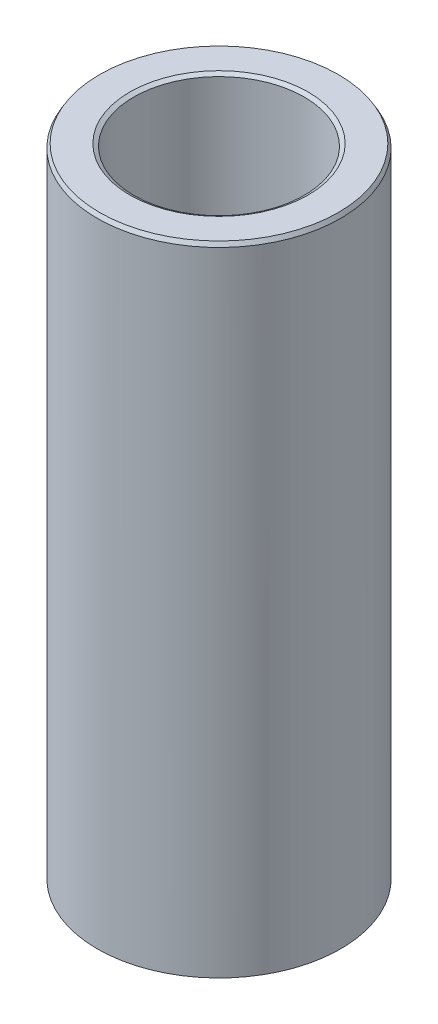
ISO-10303-21;
HEADER;
FILE_DESCRIPTION(('STEP AP214'),'2;1');
FILE_NAME('part.step','',(''),(''),'','','');
FILE_SCHEMA(('AUTOMOTIVE_DESIGN { 1 0 10303 214 1 1 1 1 }'));
ENDSEC;
DATA;
#1=APPLICATION_CONTEXT('core data for automotive mechanical design processes');
#2=APPLICATION_PROTOCOL_DEFINITION('international standard','automotive_design',2000,#1);
#3=PRODUCT_CONTEXT('',#1,'mechanical');
#4=PRODUCT('Part','Part','',(#3));
#5=PRODUCT_RELATED_PRODUCT_CATEGORY('part','',(#4));
#6=PRODUCT_DEFINITION_FORMATION('','',#4);
#7=PRODUCT_DEFINITION_CONTEXT('part definition',#1,'design');
#8=PRODUCT_DEFINITION('design','',#6,#7);
#9=PRODUCT_DEFINITION_SHAPE('','',#8);
#10=(LENGTH_UNIT() NAMED_UNIT(*) SI_UNIT(.MILLI.,.METRE.));
#11=(NAMED_UNIT(*) PLANE_ANGLE_UNIT() SI_UNIT($,.RADIAN.));
#12=(NAMED_UNIT(*) SI_UNIT($,.STERADIAN.) SOLID_ANGLE_UNIT());
#13=UNCERTAINTY_MEASURE_WITH_UNIT(LENGTH_MEASURE(1.E-05),#10,'distance_accuracy_value','');
#14=(GEOMETRIC_REPRESENTATION_CONTEXT(3) GLOBAL_UNCERTAINTY_ASSIGNED_CONTEXT((#13)) GLOBAL_UNIT_ASSIGNED_CONTEXT((#10,
#11,#12)) REPRESENTATION_CONTEXT('',''));
#15=CARTESIAN_POINT('',(0.,0.,0.));
#16=DIRECTION('',(0.,0.,1.));
#17=DIRECTION('',(1.,0.,0.));
#18=AXIS2_PLACEMENT_3D('',#15,#16,#17);
#19=CARTESIAN_POINT('',(0.,301.809116929942,0.));
#20=DIRECTION('',(0.,-1.,0.));
#21=DIRECTION('',(0.,0.,-1.));
#22=AXIS2_PLACEMENT_3D('',#19,#20,#21);
#23=CYLINDRICAL_SURFACE('',#22,57.5);
#24=CARTESIAN_POINT('',(0.,1.08632035460499,0.));
#25=DIRECTION('',(0.,1.,0.));
#26=DIRECTION('',(0.,0.,1.));
#27=AXIS2_PLACEMENT_3D('',#24,#25,#26);
#28=CIRCLE('',#27,57.5);
#29=CARTESIAN_POINT('',(0.,1.08632035460499,57.5));
#30=VERTEX_POINT('',#29);
#31=EDGE_CURVE('E10',#30,#30,#28,.T.);
#32=ORIENTED_EDGE('',*,*,#31,.T.);
#33=EDGE_LOOP('',(#32));
#34=FACE_BOUND('',#33,.T.);
#35=CARTESIAN_POINT('',(0.,299.92755488247,0.));
#36=DIRECTION('',(0.,1.,0.));
#37=DIRECTION('',(0.,0.,1.));
#38=AXIS2_PLACEMENT_3D('',#35,#36,#37);
#39=CIRCLE('',#38,57.5);
#40=CARTESIAN_POINT('',(0.,299.92755488247,-57.5));
#41=VERTEX_POINT('',#40);
#42=EDGE_CURVE('E50',#41,#41,#39,.F.);
#43=ORIENTED_EDGE('',*,*,#42,.T.);
#44=EDGE_LOOP('',(#43));
#45=FACE_BOUND('',#44,.T.);
#46=ADVANCED_FACE('F39',(#34,#45),#23,.T.);
#47=CARTESIAN_POINT('',(0.,301.809116929942,0.));
#48=DIRECTION('',(0.,1.,0.));
#49=DIRECTION('',(0.,0.,1.));
#50=AXIS2_PLACEMENT_3D('',#47,#48,#49);
#51=PLANE('',#50);
#52=CARTESIAN_POINT('',(0.,301.809116929942,0.));
#53=DIRECTION('',(0.,1.,0.));
#54=DIRECTION('',(0.,0.,1.));
#55=AXIS2_PLACEMENT_3D('',#52,#53,#54);
#56=CIRCLE('',#55,42.1466248989635);
#57=CARTESIAN_POINT('',(0.,301.809116929942,42.1466248989635));
#58=VERTEX_POINT('',#57);
#59=EDGE_CURVE('E58',#58,#58,#56,.F.);
#60=ORIENTED_EDGE('',*,*,#59,.T.);
#61=EDGE_LOOP('',(#60));
#62=FACE_BOUND('',#61,.T.);
#63=CARTESIAN_POINT('',(0.,301.809116929942,0.));
#64=DIRECTION('',(0.,1.,0.));
#65=DIRECTION('',(0.,0.,1.));
#66=AXIS2_PLACEMENT_3D('',#63,#64,#65);
#67=CIRCLE('',#66,56.4136796453951);
#68=CARTESIAN_POINT('',(0.,301.809116929942,-56.4136796453951));
#69=VERTEX_POINT('',#68);
#70=EDGE_CURVE('E61',#69,#69,#67,.T.);
#71=ORIENTED_EDGE('',*,*,#70,.T.);
#72=EDGE_LOOP('',(#71));
#73=FACE_BOUND('',#72,.T.);
#74=ADVANCED_FACE('F88',(#62,#73),#51,.T.);
#75=CARTESIAN_POINT('',(0.,0.,0.));
#76=DIRECTION('',(0.,1.,0.));
#77=DIRECTION('',(0.,0.,1.));
#78=AXIS2_PLACEMENT_3D('',#75,#76,#77);
#79=PLANE('',#78);
#80=CARTESIAN_POINT('',(0.,0.,0.));
#81=DIRECTION('',(0.,1.,0.));
#82=DIRECTION('',(0.,0.,1.));
#83=AXIS2_PLACEMENT_3D('',#80,#81,#82);
#84=CIRCLE('',#83,41.3513832060963);
#85=CARTESIAN_POINT('',(0.,0.,-41.3513832060963));
#86=VERTEX_POINT('',#85);
#87=EDGE_CURVE('E51',#86,#86,#84,.T.);
#88=ORIENTED_EDGE('',*,*,#87,.T.);
#89=EDGE_LOOP('',(#88));
#90=FACE_BOUND('',#89,.T.);
#91=CARTESIAN_POINT('',(0.,0.,0.));
#92=DIRECTION('',(0.,1.,0.));
#93=DIRECTION('',(0.,0.,1.));
#94=AXIS2_PLACEMENT_3D('',#91,#92,#93);
#95=CIRCLE('',#94,55.618437952528);
#96=CARTESIAN_POINT('',(0.,0.,55.618437952528));
#97=VERTEX_POINT('',#96);
#98=EDGE_CURVE('E54',#97,#97,#95,.F.);
#99=ORIENTED_EDGE('',*,*,#98,.T.);
#100=EDGE_LOOP('',(#99));
#101=FACE_BOUND('',#100,.T.);
#102=ADVANCED_FACE('F83',(#90,#101),#79,.F.);
#103=CARTESIAN_POINT('',(0.,301.809116929942,0.));
#104=DIRECTION('',(0.,-1.,0.));
#105=DIRECTION('',(0.,0.,-1.));
#106=AXIS2_PLACEMENT_3D('',#103,#104,#105);
#107=CYLINDRICAL_SURFACE('',#106,40.2650628514914);
#108=CARTESIAN_POINT('',(0.,300.722796575337,0.));
#109=DIRECTION('',(0.,1.,0.));
#110=DIRECTION('',(0.,0.,1.));
#111=AXIS2_PLACEMENT_3D('',#108,#109,#110);
#112=CIRCLE('',#111,40.2650628514914);
#113=CARTESIAN_POINT('',(0.,300.722796575337,40.2650628514914));
#114=VERTEX_POINT('',#113);
#115=EDGE_CURVE('E67',#114,#114,#112,.T.);
#116=ORIENTED_EDGE('',*,*,#115,.T.);
#117=EDGE_LOOP('',(#116));
#118=FACE_BOUND('',#117,.T.);
#119=CARTESIAN_POINT('',(0.,1.88156204747197,0.));
#120=DIRECTION('',(0.,1.,0.));
#121=DIRECTION('',(0.,0.,1.));
#122=AXIS2_PLACEMENT_3D('',#119,#120,#121);
#123=CIRCLE('',#122,40.2650628514914);
#124=CARTESIAN_POINT('',(0.,1.88156204747197,-40.2650628514914));
#125=VERTEX_POINT('',#124);
#126=EDGE_CURVE('E69',#125,#125,#123,.F.);
#127=ORIENTED_EDGE('',*,*,#126,.T.);
#128=EDGE_LOOP('',(#127));
#129=FACE_BOUND('',#128,.T.);
#130=ADVANCED_FACE('F71',(#118,#129),#107,.F.);
#131=CARTESIAN_POINT('',(0.,300.722796575337,0.));
#132=DIRECTION('',(0.,1.,0.));
#133=DIRECTION('',(0.,0.,1.));
#134=AXIS2_PLACEMENT_3D('',#131,#132,#133);
#135=CONICAL_SURFACE('',#134,40.2650628514914,1.0471975511966);
#136=ORIENTED_EDGE('',*,*,#59,.F.);
#137=EDGE_LOOP('',(#136));
#138=FACE_BOUND('',#137,.T.);
#139=ORIENTED_EDGE('',*,*,#115,.F.);
#140=EDGE_LOOP('',(#139));
#141=FACE_BOUND('',#140,.T.);
#142=ADVANCED_FACE('F77',(#138,#141),#135,.F.);
#143=CARTESIAN_POINT('',(0.,0.,0.));
#144=DIRECTION('',(0.,-1.,0.));
#145=DIRECTION('',(0.,0.,-1.));
#146=AXIS2_PLACEMENT_3D('',#143,#144,#145);
#147=CONICAL_SURFACE('',#146,41.3513832060963,0.523598775598289);
#148=CARTESIAN_POINT('',(0.,1.88156204747197,-40.2650628514914));
#149=CARTESIAN_POINT('',(0.,1.86196244281081,-40.2763786885185));
#150=CARTESIAN_POINT('',(0.,1.84236283814964,-40.2876945255457));
#151=CARTESIAN_POINT('',(0.,1.80316362882731,-40.3103261995999));
#152=CARTESIAN_POINT('',(0.,1.78356402416614,-40.3216420366271));
#153=CARTESIAN_POINT('',(0.,1.74436481484381,-40.3442737106813));
#154=CARTESIAN_POINT('',(0.,1.72476521018264,-40.3555895477085));
#155=CARTESIAN_POINT('',(0.,1.68556600086031,-40.3782212217627));
#156=CARTESIAN_POINT('',(0.,1.66596639619914,-40.3895370587899));
#157=CARTESIAN_POINT('',(0.,1.62676718687681,-40.4121687328441));
#158=CARTESIAN_POINT('',(0.,1.60716758221564,-40.4234845698713));
#159=CARTESIAN_POINT('',(0.,1.56796837289331,-40.4461162439255));
#160=CARTESIAN_POINT('',(0.,1.54836876823215,-40.4574320809527));
#161=CARTESIAN_POINT('',(0.,1.50916955890981,-40.480063755007));
#162=CARTESIAN_POINT('',(0.,1.48956995424865,-40.4913795920341));
#163=CARTESIAN_POINT('',(0.,1.45037074492631,-40.5140112660883));
#164=CARTESIAN_POINT('',(0.,1.43077114026515,-40.5253271031155));
#165=CARTESIAN_POINT('',(0.,1.39157193094281,-40.5479587771698));
#166=CARTESIAN_POINT('',(0.,1.37197232628165,-40.5592746141969));
#167=CARTESIAN_POINT('',(0.,1.33277311695932,-40.5819062882512));
#168=CARTESIAN_POINT('',(0.,1.31317351229815,-40.5932221252783));
#169=CARTESIAN_POINT('',(0.,1.27397430297582,-40.6158537993326));
#170=CARTESIAN_POINT('',(0.,1.25437469831465,-40.6271696363597));
#171=CARTESIAN_POINT('',(0.,1.21517548899232,-40.649801310414));
#172=CARTESIAN_POINT('',(0.,1.19557588433115,-40.6611171474411));
#173=CARTESIAN_POINT('',(0.,1.15637667500882,-40.6837488214954));
#174=CARTESIAN_POINT('',(0.,1.13677707034765,-40.6950646585225));
#175=CARTESIAN_POINT('',(0.,1.09757786102532,-40.7176963325768));
#176=CARTESIAN_POINT('',(0.,1.07797825636415,-40.7290121696039));
#177=CARTESIAN_POINT('',(0.,1.03877904704182,-40.7516438436582));
#178=CARTESIAN_POINT('',(0.,1.01917944238065,-40.7629596806853));
#179=CARTESIAN_POINT('',(0.,0.979980233058319,-40.7855913547396));
#180=CARTESIAN_POINT('',(0.,0.960380628397153,-40.7969071917667));
#181=CARTESIAN_POINT('',(0.,0.921181419074821,-40.819538865821));
#182=CARTESIAN_POINT('',(0.,0.901581814413655,-40.8308547028481));
#183=CARTESIAN_POINT('',(0.,0.862382605091322,-40.8534863769024));
#184=CARTESIAN_POINT('',(0.,0.842783000430155,-40.8648022139295));
#185=CARTESIAN_POINT('',(0.,0.803583791107822,-40.8874338879838));
#186=CARTESIAN_POINT('',(0.,0.783984186446655,-40.8987497250109));
#187=CARTESIAN_POINT('',(0.,0.744784977124323,-40.9213813990652));
#188=CARTESIAN_POINT('',(0.,0.725185372463157,-40.9326972360923));
#189=CARTESIAN_POINT('',(0.,0.685986163140824,-40.9553289101466));
#190=CARTESIAN_POINT('',(0.,0.666386558479657,-40.9666447471737));
#191=CARTESIAN_POINT('',(0.,0.627187349157324,-40.989276421228));
#192=CARTESIAN_POINT('',(0.,0.607587744496159,-41.0005922582551));
#193=CARTESIAN_POINT('',(0.,0.568388535173826,-41.0232239323094));
#194=CARTESIAN_POINT('',(0.,0.548788930512659,-41.0345397693365));
#195=CARTESIAN_POINT('',(0.,0.509589721190326,-41.0571714433908));
#196=CARTESIAN_POINT('',(0.,0.48999011652916,-41.0684872804179));
#197=CARTESIAN_POINT('',(0.,0.450790907206827,-41.0911189544722));
#198=CARTESIAN_POINT('',(0.,0.431191302545661,-41.1024347914993));
#199=CARTESIAN_POINT('',(0.,0.391992093223328,-41.1250664655536));
#200=CARTESIAN_POINT('',(0.,0.372392488562161,-41.1363823025807));
#201=CARTESIAN_POINT('',(0.,0.333193279239828,-41.159013976635));
#202=CARTESIAN_POINT('',(0.,0.313593674578662,-41.1703298136621));
#203=CARTESIAN_POINT('',(0.,0.27439446525633,-41.1929614877164));
#204=CARTESIAN_POINT('',(0.,0.254794860595164,-41.2042773247436));
#205=CARTESIAN_POINT('',(0.,0.215595651272831,-41.2269089987978));
#206=CARTESIAN_POINT('',(0.,0.195996046611663,-41.238224835825));
#207=CARTESIAN_POINT('',(0.,0.156796837289331,-41.2608565098792));
#208=CARTESIAN_POINT('',(0.,0.137197232628165,-41.2721723469064));
#209=CARTESIAN_POINT('',(0.,0.0979980233058326,-41.2948040209606));
#210=CARTESIAN_POINT('',(0.,0.0783984186446657,-41.3061198579878));
#211=CARTESIAN_POINT('',(0.,0.0391992093223317,-41.328751532042));
#212=CARTESIAN_POINT('',(0.,0.0195996046611648,-41.3400673690692));
#213=CARTESIAN_POINT('',(0.,0.,-41.3513832060963));
#214=B_SPLINE_CURVE_WITH_KNOTS('',3,(#148,#149,#150,#151,#152,#153,#154,#155,#156,#157,#158,
#159,#160,#161,#162,#163,#164,#165,#166,#167,#168,#169,#170,#171,#172,#173,#174,#175,#176,#177,
#178,#179,#180,#181,#182,#183,#184,#185,#186,#187,#188,#189,#190,#191,#192,#193,#194,#195,#196,
#197,#198,#199,#200,#201,#202,#203,#204,#205,#206,#207,#208,#209,#210,#211,#212,#213),
.UNSPECIFIED.,.F.,.F.,(4,2,2,2,2,2,2,2,2,2,2,2,2,2,2,2,2,2,2,2,2,2,2,2,2,2,2,2,2,2,2,2,4),(0.,
0.0678950221628089,0.135790044325614,0.203685066488423,0.271580088651232,0.339475110814038,
0.407370132976846,0.475265155139652,0.543160177302461,0.61105519946527,0.678950221628075,
0.746845243790884,0.814740265953693,0.882635288116498,0.950530310279307,1.01842533244211,
1.08632035460492,1.15421537676773,1.22211039893054,1.29000542109334,1.35790044325615,
1.42579546541896,1.49369048758177,1.56158550974457,1.62948053190738,1.69737555407019,
1.765270576233,1.8331655983958,1.90106062055861,1.96895564272142,2.03685066488423,
2.10474568704703,2.17264070920984),.UNSPECIFIED.);
#215=EDGE_CURVE('BSEAM73',#125,#86,#214,.T.);
#216=ORIENTED_EDGE('',*,*,#126,.F.);
#217=ORIENTED_EDGE('',*,*,#87,.F.);
#218=ORIENTED_EDGE('',*,*,#215,.T.);
#219=ORIENTED_EDGE('',*,*,#215,.F.);
#220=EDGE_LOOP('',(#216,#218,#217,#219));
#221=FACE_BOUND('',#220,.T.);
#222=ADVANCED_FACE('F73',(#221),#147,.F.);
#223=CARTESIAN_POINT('',(0.,1.08632035460499,0.));
#224=DIRECTION('',(0.,1.,0.));
#225=DIRECTION('',(0.,0.,1.));
#226=AXIS2_PLACEMENT_3D('',#223,#224,#225);
#227=CONICAL_SURFACE('',#226,57.5,1.04719755119659);
#228=ORIENTED_EDGE('',*,*,#98,.F.);
#229=EDGE_LOOP('',(#228));
#230=FACE_BOUND('',#229,.T.);
#231=ORIENTED_EDGE('',*,*,#31,.F.);
#232=EDGE_LOOP('',(#231));
#233=FACE_BOUND('',#232,.T.);
#234=ADVANCED_FACE('F76',(#230,#233),#227,.T.);
#235=CARTESIAN_POINT('',(0.,301.809116929942,0.));
#236=DIRECTION('',(0.,-1.,0.));
#237=DIRECTION('',(0.,0.,-1.));
#238=AXIS2_PLACEMENT_3D('',#235,#236,#237);
#239=CONICAL_SURFACE('',#238,56.4136796453951,0.523598775598303);
#240=CARTESIAN_POINT('',(0.,299.92755488247,-57.5));
#241=CARTESIAN_POINT('',(0.,299.947154487132,-57.4886841629729));
#242=CARTESIAN_POINT('',(0.,299.966754091793,-57.4773683259457));
#243=CARTESIAN_POINT('',(0.,300.005953301115,-57.4547366518915));
#244=CARTESIAN_POINT('',(0.,300.025552905776,-57.4434208148644));
#245=CARTESIAN_POINT('',(0.,300.064752115098,-57.4207891408101));
#246=CARTESIAN_POINT('',(0.,300.08435171976,-57.4094733037829));
#247=CARTESIAN_POINT('',(0.,300.123550929082,-57.3868416297287));
#248=CARTESIAN_POINT('',(0.,300.143150533743,-57.3755257927015));
#249=CARTESIAN_POINT('',(0.,300.182349743066,-57.3528941186473));
#250=CARTESIAN_POINT('',(0.,300.201949347727,-57.3415782816201));
#251=CARTESIAN_POINT('',(0.,300.241148557049,-57.3189466075659));
#252=CARTESIAN_POINT('',(0.,300.26074816171,-57.3076307705387));
#253=CARTESIAN_POINT('',(0.,300.299947371032,-57.2849990964845));
#254=CARTESIAN_POINT('',(0.,300.319546975694,-57.2736832594573));
#255=CARTESIAN_POINT('',(0.,300.358746185016,-57.2510515854031));
#256=CARTESIAN_POINT('',(0.,300.378345789677,-57.2397357483759));
#257=CARTESIAN_POINT('',(0.,300.417544998999,-57.2171040743217));
#258=CARTESIAN_POINT('',(0.,300.437144603661,-57.2057882372945));
#259=CARTESIAN_POINT('',(0.,300.476343812983,-57.1831565632402));
#260=CARTESIAN_POINT('',(0.,300.495943417644,-57.1718407262131));
#261=CARTESIAN_POINT('',(0.,300.535142626966,-57.1492090521588));
#262=CARTESIAN_POINT('',(0.,300.554742231628,-57.1378932151317));
#263=CARTESIAN_POINT('',(0.,300.59394144095,-57.1152615410774));
#264=CARTESIAN_POINT('',(0.,300.613541045611,-57.1039457040503));
#265=CARTESIAN_POINT('',(0.,300.652740254934,-57.081314029996));
#266=CARTESIAN_POINT('',(0.,300.672339859595,-57.0699981929689));
#267=CARTESIAN_POINT('',(0.,300.711539068917,-57.0473665189146));
#268=CARTESIAN_POINT('',(0.,300.731138673578,-57.0360506818875));
#269=CARTESIAN_POINT('',(0.,300.7703378829,-57.0134190078332));
#270=CARTESIAN_POINT('',(0.,300.789937487562,-57.0021031708061));
#271=CARTESIAN_POINT('',(0.,300.829136696884,-56.9794714967518));
#272=CARTESIAN_POINT('',(0.,300.848736301545,-56.9681556597247));
#273=CARTESIAN_POINT('',(0.,300.887935510868,-56.9455239856704));
#274=CARTESIAN_POINT('',(0.,300.907535115529,-56.9342081486433));
#275=CARTESIAN_POINT('',(0.,300.946734324851,-56.911576474589));
#276=CARTESIAN_POINT('',(0.,300.966333929512,-56.9002606375619));
#277=CARTESIAN_POINT('',(0.,301.005533138834,-56.8776289635076));
#278=CARTESIAN_POINT('',(0.,301.025132743496,-56.8663131264805));
#279=CARTESIAN_POINT('',(0.,301.064331952818,-56.8436814524262));
#280=CARTESIAN_POINT('',(0.,301.083931557479,-56.8323656153991));
#281=CARTESIAN_POINT('',(0.,301.123130766801,-56.8097339413448));
#282=CARTESIAN_POINT('',(0.,301.142730371463,-56.7984181043177));
#283=CARTESIAN_POINT('',(0.,301.181929580785,-56.7757864302634));
#284=CARTESIAN_POINT('',(0.,301.201529185446,-56.7644705932363));
#285=CARTESIAN_POINT('',(0.,301.240728394768,-56.741838919182));
#286=CARTESIAN_POINT('',(0.,301.26032799943,-56.7305230821549));
#287=CARTESIAN_POINT('',(0.,301.299527208752,-56.7078914081006));
#288=CARTESIAN_POINT('',(0.,301.319126813413,-56.6965755710735));
#289=CARTESIAN_POINT('',(0.,301.358326022735,-56.6739438970192));
#290=CARTESIAN_POINT('',(0.,301.377925627397,-56.662628059992));
#291=CARTESIAN_POINT('',(0.,301.417124836719,-56.6399963859378));
#292=CARTESIAN_POINT('',(0.,301.43672444138,-56.6286805489106));
#293=CARTESIAN_POINT('',(0.,301.475923650702,-56.6060488748564));
#294=CARTESIAN_POINT('',(0.,301.495523255364,-56.5947330378292));
#295=CARTESIAN_POINT('',(0.,301.534722464686,-56.572101363775));
#296=CARTESIAN_POINT('',(0.,301.554322069347,-56.5607855267478));
#297=CARTESIAN_POINT('',(0.,301.59352127867,-56.5381538526936));
#298=CARTESIAN_POINT('',(0.,301.613120883331,-56.5268380156664));
#299=CARTESIAN_POINT('',(0.,301.652320092653,-56.5042063416122));
#300=CARTESIAN_POINT('',(0.,301.671919697314,-56.492890504585));
#301=CARTESIAN_POINT('',(0.,301.711118906637,-56.4702588305308));
#302=CARTESIAN_POINT('',(0.,301.730718511298,-56.4589429935036));
#303=CARTESIAN_POINT('',(0.,301.76991772062,-56.4363113194494));
#304=CARTESIAN_POINT('',(0.,301.789517325281,-56.4249954824222));
#305=CARTESIAN_POINT('',(0.,301.809116929942,-56.4136796453951));
#306=B_SPLINE_CURVE_WITH_KNOTS('',3,(#240,#241,#242,#243,#244,#245,#246,#247,#248,#249,#250,
#251,#252,#253,#254,#255,#256,#257,#258,#259,#260,#261,#262,#263,#264,#265,#266,#267,#268,#269,
#270,#271,#272,#273,#274,#275,#276,#277,#278,#279,#280,#281,#282,#283,#284,#285,#286,#287,#288,
#289,#290,#291,#292,#293,#294,#295,#296,#297,#298,#299,#300,#301,#302,#303,#304,#305),
.UNSPECIFIED.,.F.,.F.,(4,2,2,2,2,2,2,2,2,2,2,2,2,2,2,2,2,2,2,2,2,2,2,2,2,2,2,2,2,2,2,2,4),(0.,
0.0678950221628219,0.135790044325647,0.203685066488425,0.27158008865125,0.339475110814076,
0.407370132976849,0.475265155139675,0.5431601773025,0.611055199465278,0.6789502216281,
0.746845243790925,0.814740265953702,0.882635288116528,0.950530310279353,1.01842533244213,
1.08632035460495,1.15421537676778,1.22211039893056,1.29000542109338,1.3579004432562,
1.42579546541898,1.49369048758181,1.56158550974463,1.62948053190741,1.69737555407023,
1.76527057623306,1.83316559839583,1.90106062055866,1.96895564272148,2.03685066488426,
2.10474568704708,2.17264070920991),.UNSPECIFIED.);
#307=EDGE_CURVE('BSEAM45',#41,#69,#306,.T.);
#308=ORIENTED_EDGE('',*,*,#42,.F.);
#309=ORIENTED_EDGE('',*,*,#70,.F.);
#310=ORIENTED_EDGE('',*,*,#307,.T.);
#311=ORIENTED_EDGE('',*,*,#307,.F.);
#312=EDGE_LOOP('',(#308,#310,#309,#311));
#313=FACE_BOUND('',#312,.T.);
#314=ADVANCED_FACE('F45',(#313),#239,.T.);
#315=CLOSED_SHELL('',(#46,#74,#102,#130,#142,#222,#234,#314));
#316=MANIFOLD_SOLID_BREP('B2',#315);
#317=ADVANCED_BREP_SHAPE_REPRESENTATION('',(#18,#316),#14);
#318=SHAPE_DEFINITION_REPRESENTATION(#9,#317);
ENDSEC;
END-ISO-10303-21;
